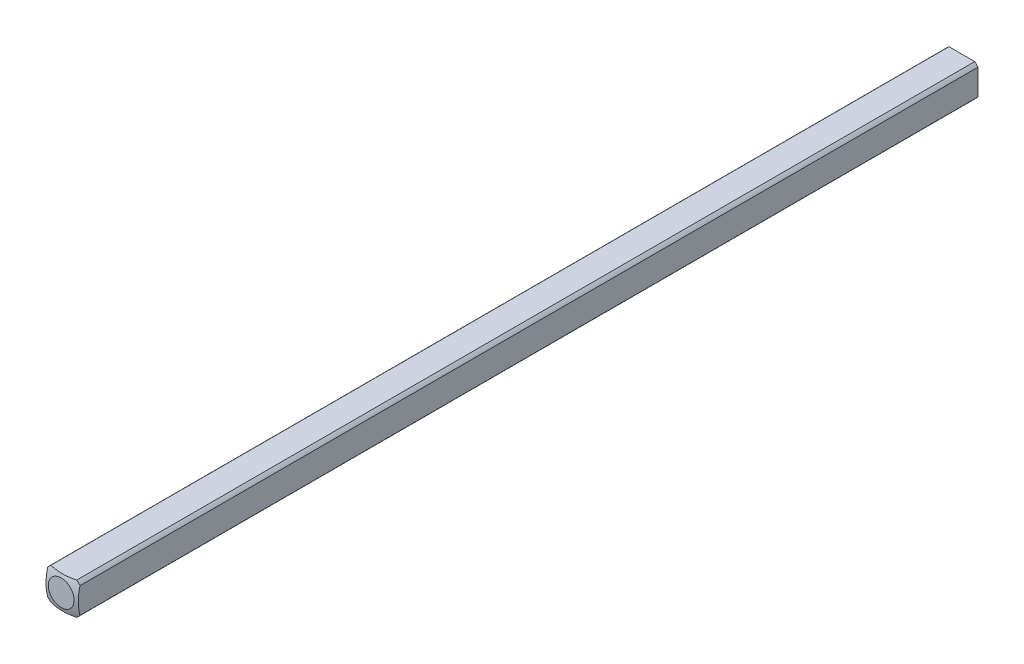
ISO-10303-21;
HEADER;
FILE_DESCRIPTION(('STEP AP214'),'2;1');
FILE_NAME('part.step','',(''),(''),'','','');
FILE_SCHEMA(('AUTOMOTIVE_DESIGN { 1 0 10303 214 1 1 1 1 }'));
ENDSEC;
DATA;
#1=APPLICATION_CONTEXT('core data for automotive mechanical design processes');
#2=APPLICATION_PROTOCOL_DEFINITION('international standard','automotive_design',2000,#1);
#3=PRODUCT_CONTEXT('',#1,'mechanical');
#4=PRODUCT('Part','Part','',(#3));
#5=PRODUCT_RELATED_PRODUCT_CATEGORY('part','',(#4));
#6=PRODUCT_DEFINITION_FORMATION('','',#4);
#7=PRODUCT_DEFINITION_CONTEXT('part definition',#1,'design');
#8=PRODUCT_DEFINITION('design','',#6,#7);
#9=PRODUCT_DEFINITION_SHAPE('','',#8);
#10=(LENGTH_UNIT() NAMED_UNIT(*) SI_UNIT(.MILLI.,.METRE.));
#11=(NAMED_UNIT(*) PLANE_ANGLE_UNIT() SI_UNIT($,.RADIAN.));
#12=(NAMED_UNIT(*) SI_UNIT($,.STERADIAN.) SOLID_ANGLE_UNIT());
#13=UNCERTAINTY_MEASURE_WITH_UNIT(LENGTH_MEASURE(1.E-05),#10,'distance_accuracy_value','');
#14=(GEOMETRIC_REPRESENTATION_CONTEXT(3) GLOBAL_UNCERTAINTY_ASSIGNED_CONTEXT((#13)) GLOBAL_UNIT_ASSIGNED_CONTEXT((#10,
#11,#12)) REPRESENTATION_CONTEXT('',''));
#15=CARTESIAN_POINT('',(0.,0.,0.));
#16=DIRECTION('',(0.,0.,1.));
#17=DIRECTION('',(1.,0.,0.));
#18=AXIS2_PLACEMENT_3D('',#15,#16,#17);
#19=CARTESIAN_POINT('',(-1.5875,-1.5875,152.4));
#20=DIRECTION('',(1.,0.,0.));
#21=DIRECTION('',(0.,0.,-1.));
#22=AXIS2_PLACEMENT_3D('',#19,#20,#21);
#23=PLANE('',#22);
#24=DIRECTION('',(0.,0.,-1.));
#25=VECTOR('',#24,1.);
#26=CARTESIAN_POINT('',(-1.5875,1.26841150657032,152.4));
#27=LINE('',#26,#25);
#28=CARTESIAN_POINT('',(-1.5875,1.26841150657032,216.163225357687));
#29=VERTEX_POINT('',#28);
#30=CARTESIAN_POINT('',(-1.5875,1.26841150657032,304.536774642313));
#31=VERTEX_POINT('',#30);
#32=EDGE_CURVE('E54',#29,#31,#27,.F.);
#33=ORIENTED_EDGE('',*,*,#32,.F.);
#34=DIRECTION('',(0.,-1.,0.));
#35=VECTOR('',#34,1.);
#36=CARTESIAN_POINT('',(-1.5875,1.5875,216.163225357687));
#37=LINE('',#36,#35);
#38=CARTESIAN_POINT('',(-1.5875,-1.26841150657032,216.163225357687));
#39=VERTEX_POINT('',#38);
#40=EDGE_CURVE('E47',#29,#39,#37,.T.);
#41=ORIENTED_EDGE('',*,*,#40,.T.);
#42=DIRECTION('',(0.,0.,-1.));
#43=VECTOR('',#42,1.);
#44=CARTESIAN_POINT('',(-1.5875,-1.26841150657032,152.4));
#45=LINE('',#44,#43);
#46=CARTESIAN_POINT('',(-1.5875,-1.26841150657032,304.536774642313));
#47=VERTEX_POINT('',#46);
#48=EDGE_CURVE('E41',#47,#39,#45,.T.);
#49=ORIENTED_EDGE('',*,*,#48,.F.);
#50=CARTESIAN_POINT('',(-1.5875,0.,299.880877736238));
#51=DIRECTION('',(-1.,0.,0.));
#52=DIRECTION('',(0.,0.,1.));
#53=AXIS2_PLACEMENT_3D('',#50,#51,#52);
#54=CIRCLE('',#53,4.82558221875869);
#55=EDGE_CURVE('E136',#47,#31,#54,.T.);
#56=ORIENTED_EDGE('',*,*,#55,.T.);
#57=EDGE_LOOP('',(#33,#41,#49,#56));
#58=FACE_BOUND('',#57,.T.);
#59=ADVANCED_FACE('F34',(#58),#23,.F.);
#60=CARTESIAN_POINT('',(-1.5875,-1.5875,152.4));
#61=DIRECTION('',(0.,1.,0.));
#62=DIRECTION('',(0.,0.,1.));
#63=AXIS2_PLACEMENT_3D('',#60,#61,#62);
#64=PLANE('',#63);
#65=DIRECTION('',(0.,0.,-1.));
#66=VECTOR('',#65,1.);
#67=CARTESIAN_POINT('',(-1.26841150657032,-1.5875,152.4));
#68=LINE('',#67,#66);
#69=CARTESIAN_POINT('',(-1.26841150657032,-1.5875,216.163225357687));
#70=VERTEX_POINT('',#69);
#71=CARTESIAN_POINT('',(-1.26841150657032,-1.5875,304.536774642313));
#72=VERTEX_POINT('',#71);
#73=EDGE_CURVE('E115',#70,#72,#68,.F.);
#74=ORIENTED_EDGE('',*,*,#73,.F.);
#75=DIRECTION('',(-1.,0.,0.));
#76=VECTOR('',#75,1.);
#77=CARTESIAN_POINT('',(1.5875,-1.5875,216.163225357687));
#78=LINE('',#77,#76);
#79=CARTESIAN_POINT('',(1.26841150657032,-1.5875,216.163225357687));
#80=VERTEX_POINT('',#79);
#81=EDGE_CURVE('E99',#80,#70,#78,.T.);
#82=ORIENTED_EDGE('',*,*,#81,.F.);
#83=DIRECTION('',(0.,0.,-1.));
#84=VECTOR('',#83,1.);
#85=CARTESIAN_POINT('',(1.26841150657032,-1.5875,152.4));
#86=LINE('',#85,#84);
#87=CARTESIAN_POINT('',(1.26841150657032,-1.5875,304.536774642313));
#88=VERTEX_POINT('',#87);
#89=EDGE_CURVE('E113',#88,#80,#86,.T.);
#90=ORIENTED_EDGE('',*,*,#89,.F.);
#91=CARTESIAN_POINT('',(0.,-1.5875,299.880877736238));
#92=DIRECTION('',(0.,-1.,0.));
#93=DIRECTION('',(0.,0.,-1.));
#94=AXIS2_PLACEMENT_3D('',#91,#92,#93);
#95=CIRCLE('',#94,4.82558221875869);
#96=EDGE_CURVE('E154',#88,#72,#95,.T.);
#97=ORIENTED_EDGE('',*,*,#96,.T.);
#98=EDGE_LOOP('',(#74,#82,#90,#97));
#99=FACE_BOUND('',#98,.T.);
#100=ADVANCED_FACE('F111',(#99),#64,.F.);
#101=CARTESIAN_POINT('',(1.5875,-1.5875,152.4));
#102=DIRECTION('',(-1.,0.,0.));
#103=DIRECTION('',(0.,0.,1.));
#104=AXIS2_PLACEMENT_3D('',#101,#102,#103);
#105=PLANE('',#104);
#106=DIRECTION('',(0.,0.,-1.));
#107=VECTOR('',#106,1.);
#108=CARTESIAN_POINT('',(1.5875,-1.26841150657032,152.4));
#109=LINE('',#108,#107);
#110=CARTESIAN_POINT('',(1.5875,-1.26841150657032,216.163225357687));
#111=VERTEX_POINT('',#110);
#112=CARTESIAN_POINT('',(1.5875,-1.26841150657032,304.536774642313));
#113=VERTEX_POINT('',#112);
#114=EDGE_CURVE('E167',#111,#113,#109,.F.);
#115=ORIENTED_EDGE('',*,*,#114,.F.);
#116=DIRECTION('',(0.,-1.,0.));
#117=VECTOR('',#116,1.);
#118=CARTESIAN_POINT('',(1.5875,1.5875,216.163225357687));
#119=LINE('',#118,#117);
#120=CARTESIAN_POINT('',(1.5875,1.26841150657032,216.163225357687));
#121=VERTEX_POINT('',#120);
#122=EDGE_CURVE('E102',#121,#111,#119,.T.);
#123=ORIENTED_EDGE('',*,*,#122,.F.);
#124=DIRECTION('',(0.,0.,-1.));
#125=VECTOR('',#124,1.);
#126=CARTESIAN_POINT('',(1.5875,1.26841150657032,152.4));
#127=LINE('',#126,#125);
#128=CARTESIAN_POINT('',(1.5875,1.26841150657032,304.536774642313));
#129=VERTEX_POINT('',#128);
#130=EDGE_CURVE('E124',#129,#121,#127,.T.);
#131=ORIENTED_EDGE('',*,*,#130,.F.);
#132=CARTESIAN_POINT('',(1.5875,0.,299.880877736238));
#133=DIRECTION('',(1.,0.,0.));
#134=DIRECTION('',(0.,0.,-1.));
#135=AXIS2_PLACEMENT_3D('',#132,#133,#134);
#136=CIRCLE('',#135,4.82558221875869);
#137=EDGE_CURVE('E151',#129,#113,#136,.T.);
#138=ORIENTED_EDGE('',*,*,#137,.T.);
#139=EDGE_LOOP('',(#115,#123,#131,#138));
#140=FACE_BOUND('',#139,.T.);
#141=ADVANCED_FACE('F176',(#140),#105,.F.);
#142=CARTESIAN_POINT('',(-1.5875,1.5875,152.4));
#143=DIRECTION('',(0.,-1.,0.));
#144=DIRECTION('',(0.,0.,-1.));
#145=AXIS2_PLACEMENT_3D('',#142,#143,#144);
#146=PLANE('',#145);
#147=DIRECTION('',(0.,0.,-1.));
#148=VECTOR('',#147,1.);
#149=CARTESIAN_POINT('',(1.26841150657032,1.5875,152.4));
#150=LINE('',#149,#148);
#151=CARTESIAN_POINT('',(1.26841150657032,1.5875,216.163225357687));
#152=VERTEX_POINT('',#151);
#153=CARTESIAN_POINT('',(1.26841150657032,1.5875,304.536774642313));
#154=VERTEX_POINT('',#153);
#155=EDGE_CURVE('E162',#152,#154,#150,.F.);
#156=ORIENTED_EDGE('',*,*,#155,.F.);
#157=DIRECTION('',(-1.,0.,0.));
#158=VECTOR('',#157,1.);
#159=CARTESIAN_POINT('',(1.5875,1.5875,216.163225357687));
#160=LINE('',#159,#158);
#161=CARTESIAN_POINT('',(-1.26841150657032,1.5875,216.163225357687));
#162=VERTEX_POINT('',#161);
#163=EDGE_CURVE('E116',#152,#162,#160,.T.);
#164=ORIENTED_EDGE('',*,*,#163,.T.);
#165=DIRECTION('',(0.,0.,-1.));
#166=VECTOR('',#165,1.);
#167=CARTESIAN_POINT('',(-1.26841150657032,1.5875,152.4));
#168=LINE('',#167,#166);
#169=CARTESIAN_POINT('',(-1.26841150657032,1.5875,304.536774642313));
#170=VERTEX_POINT('',#169);
#171=EDGE_CURVE('E164',#170,#162,#168,.T.);
#172=ORIENTED_EDGE('',*,*,#171,.F.);
#173=CARTESIAN_POINT('',(0.,1.5875,299.880877736238));
#174=DIRECTION('',(0.,1.,0.));
#175=DIRECTION('',(0.,0.,1.));
#176=AXIS2_PLACEMENT_3D('',#173,#174,#175);
#177=CIRCLE('',#176,4.82558221875869);
#178=EDGE_CURVE('E143',#170,#154,#177,.T.);
#179=ORIENTED_EDGE('',*,*,#178,.T.);
#180=EDGE_LOOP('',(#156,#164,#172,#179));
#181=FACE_BOUND('',#180,.T.);
#182=ADVANCED_FACE('F183',(#181),#146,.F.);
#183=CARTESIAN_POINT('',(0.,0.,152.4));
#184=DIRECTION('',(0.,0.,-1.));
#185=DIRECTION('',(-1.,0.,0.));
#186=AXIS2_PLACEMENT_3D('',#183,#184,#185);
#187=CYLINDRICAL_SURFACE('',#186,2.032);
#188=CARTESIAN_POINT('',(0.,0.,216.163225357687));
#189=DIRECTION('',(0.,0.,1.));
#190=DIRECTION('',(1.,0.,0.));
#191=AXIS2_PLACEMENT_3D('',#188,#189,#190);
#192=CIRCLE('',#191,2.032);
#193=EDGE_CURVE('E106',#70,#39,#192,.F.);
#194=ORIENTED_EDGE('',*,*,#193,.F.);
#195=ORIENTED_EDGE('',*,*,#73,.T.);
#196=CARTESIAN_POINT('',(0.,0.,304.536774642313));
#197=DIRECTION('',(0.,0.,1.));
#198=DIRECTION('',(1.,0.,0.));
#199=AXIS2_PLACEMENT_3D('',#196,#197,#198);
#200=CIRCLE('',#199,2.032);
#201=EDGE_CURVE('E132',#47,#72,#200,.T.);
#202=ORIENTED_EDGE('',*,*,#201,.F.);
#203=ORIENTED_EDGE('',*,*,#48,.T.);
#204=EDGE_LOOP('',(#194,#195,#202,#203));
#205=FACE_BOUND('',#204,.T.);
#206=ADVANCED_FACE('F130',(#205),#187,.T.);
#207=CARTESIAN_POINT('',(0.,0.,216.163225357687));
#208=DIRECTION('',(0.,0.,1.));
#209=DIRECTION('',(1.,0.,0.));
#210=AXIS2_PLACEMENT_3D('',#207,#208,#209);
#211=CIRCLE('',#210,2.032);
#212=EDGE_CURVE('E96',#111,#80,#211,.F.);
#213=ORIENTED_EDGE('',*,*,#212,.F.);
#214=ORIENTED_EDGE('',*,*,#114,.T.);
#215=CARTESIAN_POINT('',(0.,0.,304.536774642313));
#216=DIRECTION('',(0.,0.,1.));
#217=DIRECTION('',(1.,0.,0.));
#218=AXIS2_PLACEMENT_3D('',#215,#216,#217);
#219=CIRCLE('',#218,2.032);
#220=EDGE_CURVE('E120',#88,#113,#219,.T.);
#221=ORIENTED_EDGE('',*,*,#220,.F.);
#222=ORIENTED_EDGE('',*,*,#89,.T.);
#223=EDGE_LOOP('',(#213,#214,#221,#222));
#224=FACE_BOUND('',#223,.T.);
#225=ADVANCED_FACE('F118',(#224),#187,.T.);
#226=CARTESIAN_POINT('',(0.,0.,216.163225357687));
#227=DIRECTION('',(0.,0.,1.));
#228=DIRECTION('',(1.,0.,0.));
#229=AXIS2_PLACEMENT_3D('',#226,#227,#228);
#230=CIRCLE('',#229,2.032);
#231=EDGE_CURVE('E107',#152,#121,#230,.F.);
#232=ORIENTED_EDGE('',*,*,#231,.F.);
#233=ORIENTED_EDGE('',*,*,#155,.T.);
#234=CARTESIAN_POINT('',(0.,0.,304.536774642313));
#235=DIRECTION('',(0.,0.,1.));
#236=DIRECTION('',(1.,0.,0.));
#237=AXIS2_PLACEMENT_3D('',#234,#235,#236);
#238=CIRCLE('',#237,2.032);
#239=EDGE_CURVE('E147',#129,#154,#238,.T.);
#240=ORIENTED_EDGE('',*,*,#239,.F.);
#241=ORIENTED_EDGE('',*,*,#130,.T.);
#242=EDGE_LOOP('',(#232,#233,#240,#241));
#243=FACE_BOUND('',#242,.T.);
#244=ADVANCED_FACE('F172',(#243),#187,.T.);
#245=CARTESIAN_POINT('',(0.,0.,216.163225357687));
#246=DIRECTION('',(0.,0.,1.));
#247=DIRECTION('',(1.,0.,0.));
#248=AXIS2_PLACEMENT_3D('',#245,#246,#247);
#249=CIRCLE('',#248,2.032);
#250=EDGE_CURVE('E12',#29,#162,#249,.F.);
#251=ORIENTED_EDGE('',*,*,#250,.F.);
#252=ORIENTED_EDGE('',*,*,#32,.T.);
#253=CARTESIAN_POINT('',(0.,0.,304.536774642313));
#254=DIRECTION('',(0.,0.,1.));
#255=DIRECTION('',(1.,0.,0.));
#256=AXIS2_PLACEMENT_3D('',#253,#254,#255);
#257=CIRCLE('',#256,2.032);
#258=EDGE_CURVE('E160',#170,#31,#257,.T.);
#259=ORIENTED_EDGE('',*,*,#258,.F.);
#260=ORIENTED_EDGE('',*,*,#171,.T.);
#261=EDGE_LOOP('',(#251,#252,#259,#260));
#262=FACE_BOUND('',#261,.T.);
#263=ADVANCED_FACE('F180',(#262),#187,.T.);
#264=CARTESIAN_POINT('',(0.,0.,299.880877736238));
#265=DIRECTION('',(0.,0.,-1.));
#266=DIRECTION('',(-1.,0.,0.));
#267=AXIS2_PLACEMENT_3D('',#264,#265,#266);
#268=SPHERICAL_SURFACE('',#267,5.08);
#269=CARTESIAN_POINT('',(0.,0.,304.8));
#270=DIRECTION('',(0.,0.,-1.));
#271=DIRECTION('',(-1.,0.,0.));
#272=AXIS2_PLACEMENT_3D('',#269,#270,#271);
#273=CIRCLE('',#272,1.26832020963187);
#274=CARTESIAN_POINT('',(-1.26832020963187,0.,304.8));
#275=VERTEX_POINT('',#274);
#276=EDGE_CURVE('E157',#275,#275,#273,.T.);
#277=ORIENTED_EDGE('',*,*,#276,.T.);
#278=EDGE_LOOP('',(#277));
#279=FACE_BOUND('',#278,.T.);
#280=ORIENTED_EDGE('',*,*,#96,.F.);
#281=ORIENTED_EDGE('',*,*,#220,.T.);
#282=ORIENTED_EDGE('',*,*,#137,.F.);
#283=ORIENTED_EDGE('',*,*,#239,.T.);
#284=ORIENTED_EDGE('',*,*,#178,.F.);
#285=ORIENTED_EDGE('',*,*,#258,.T.);
#286=ORIENTED_EDGE('',*,*,#55,.F.);
#287=ORIENTED_EDGE('',*,*,#201,.T.);
#288=EDGE_LOOP('',(#280,#281,#282,#283,#284,#285,#286,#287));
#289=FACE_BOUND('',#288,.T.);
#290=ADVANCED_FACE('F178',(#279,#289),#268,.T.);
#291=CARTESIAN_POINT('',(0.,0.,304.8));
#292=DIRECTION('',(0.,0.,1.));
#293=DIRECTION('',(-1.,0.,0.));
#294=AXIS2_PLACEMENT_3D('',#291,#292,#293);
#295=PLANE('',#294);
#296=ORIENTED_EDGE('',*,*,#276,.F.);
#297=EDGE_LOOP('',(#296));
#298=FACE_BOUND('',#297,.T.);
#299=ADVANCED_FACE('F250',(#298),#295,.T.);
#300=CARTESIAN_POINT('',(1.5875,1.5875,216.163225357687));
#301=DIRECTION('',(0.,0.,1.));
#302=DIRECTION('',(1.,0.,0.));
#303=AXIS2_PLACEMENT_3D('',#300,#301,#302);
#304=PLANE('',#303);
#305=ORIENTED_EDGE('',*,*,#193,.T.);
#306=ORIENTED_EDGE('',*,*,#40,.F.);
#307=ORIENTED_EDGE('',*,*,#250,.T.);
#308=ORIENTED_EDGE('',*,*,#163,.F.);
#309=ORIENTED_EDGE('',*,*,#231,.T.);
#310=ORIENTED_EDGE('',*,*,#122,.T.);
#311=ORIENTED_EDGE('',*,*,#212,.T.);
#312=ORIENTED_EDGE('',*,*,#81,.T.);
#313=EDGE_LOOP('',(#305,#306,#307,#308,#309,#310,#311,#312));
#314=FACE_BOUND('',#313,.T.);
#315=ADVANCED_FACE('F98',(#314),#304,.F.);
#316=CLOSED_SHELL('',(#59,#100,#141,#182,#206,#225,#244,#263,#290,#299,#315));
#317=MANIFOLD_SOLID_BREP('B2',#316);
#318=ADVANCED_BREP_SHAPE_REPRESENTATION('',(#18,#317),#14);
#319=SHAPE_DEFINITION_REPRESENTATION(#9,#318);
ENDSEC;
END-ISO-10303-21;
